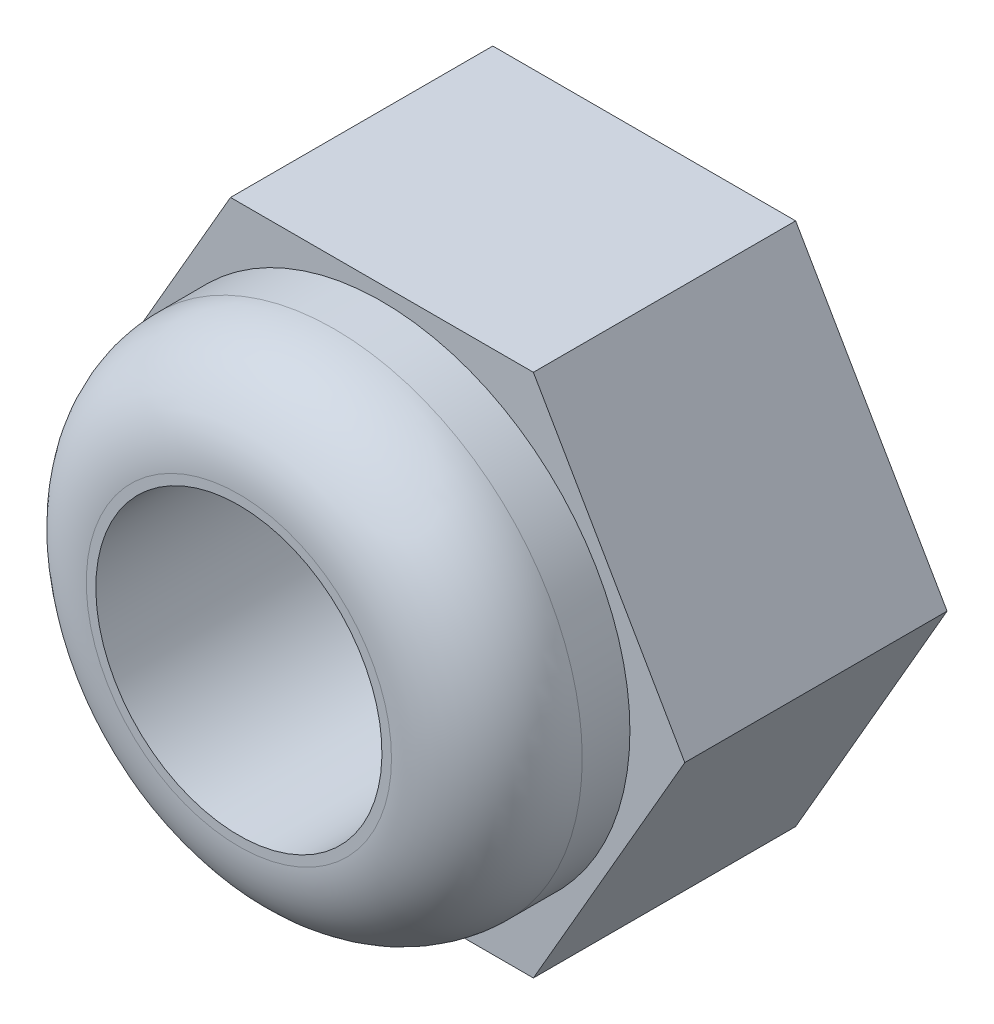
ISO-10303-21;
HEADER;
FILE_DESCRIPTION(('STEP AP214'),'2;1');
FILE_NAME('part.step','',(''),(''),'','','');
FILE_SCHEMA(('AUTOMOTIVE_DESIGN { 1 0 10303 214 1 1 1 1 }'));
ENDSEC;
DATA;
#1=APPLICATION_CONTEXT('core data for automotive mechanical design processes');
#2=APPLICATION_PROTOCOL_DEFINITION('international standard','automotive_design',2000,#1);
#3=PRODUCT_CONTEXT('',#1,'mechanical');
#4=PRODUCT('Part','Part','',(#3));
#5=PRODUCT_RELATED_PRODUCT_CATEGORY('part','',(#4));
#6=PRODUCT_DEFINITION_FORMATION('','',#4);
#7=PRODUCT_DEFINITION_CONTEXT('part definition',#1,'design');
#8=PRODUCT_DEFINITION('design','',#6,#7);
#9=PRODUCT_DEFINITION_SHAPE('','',#8);
#10=(LENGTH_UNIT() NAMED_UNIT(*) SI_UNIT(.MILLI.,.METRE.));
#11=(NAMED_UNIT(*) PLANE_ANGLE_UNIT() SI_UNIT($,.RADIAN.));
#12=(NAMED_UNIT(*) SI_UNIT($,.STERADIAN.) SOLID_ANGLE_UNIT());
#13=UNCERTAINTY_MEASURE_WITH_UNIT(LENGTH_MEASURE(1.E-05),#10,'distance_accuracy_value','');
#14=(GEOMETRIC_REPRESENTATION_CONTEXT(3) GLOBAL_UNCERTAINTY_ASSIGNED_CONTEXT((#13)) GLOBAL_UNIT_ASSIGNED_CONTEXT((#10,
#11,#12)) REPRESENTATION_CONTEXT('',''));
#15=CARTESIAN_POINT('',(0.,0.,0.));
#16=DIRECTION('',(0.,0.,1.));
#17=DIRECTION('',(1.,0.,0.));
#18=AXIS2_PLACEMENT_3D('',#15,#16,#17);
#19=CARTESIAN_POINT('',(0.,0.,2.75));
#20=DIRECTION('',(0.,0.,1.));
#21=DIRECTION('',(1.,0.,0.));
#22=AXIS2_PLACEMENT_3D('',#19,#20,#21);
#23=PLANE('',#22);
#24=CARTESIAN_POINT('',(0.,0.,2.75));
#25=DIRECTION('',(0.,0.,1.));
#26=DIRECTION('',(1.,0.,0.));
#27=AXIS2_PLACEMENT_3D('',#24,#25,#26);
#28=CIRCLE('',#27,2.6);
#29=CARTESIAN_POINT('',(2.6,0.,2.75));
#30=VERTEX_POINT('',#29);
#31=EDGE_CURVE('E20',#30,#30,#28,.T.);
#32=ORIENTED_EDGE('',*,*,#31,.F.);
#33=EDGE_LOOP('',(#32));
#34=FACE_BOUND('',#33,.T.);
#35=DIRECTION('',(0.5,0.866025403784439,0.));
#36=VECTOR('',#35,1.);
#37=CARTESIAN_POINT('',(3.17542648054294,0.,2.75));
#38=LINE('',#37,#36);
#39=CARTESIAN_POINT('',(3.17542648054294,0.,2.75));
#40=VERTEX_POINT('',#39);
#41=CARTESIAN_POINT('',(1.58771324027147,-2.75,2.75));
#42=VERTEX_POINT('',#41);
#43=EDGE_CURVE('E67',#40,#42,#38,.F.);
#44=ORIENTED_EDGE('',*,*,#43,.F.);
#45=DIRECTION('',(-0.500000000000001,0.866025403784438,0.));
#46=VECTOR('',#45,1.);
#47=CARTESIAN_POINT('',(1.58771324027147,2.75,2.75));
#48=LINE('',#47,#46);
#49=CARTESIAN_POINT('',(1.58771324027147,2.75,2.75));
#50=VERTEX_POINT('',#49);
#51=EDGE_CURVE('E157',#50,#40,#48,.F.);
#52=ORIENTED_EDGE('',*,*,#51,.F.);
#53=DIRECTION('',(1.,0.,0.));
#54=VECTOR('',#53,1.);
#55=CARTESIAN_POINT('',(-1.58771324027147,2.75,2.75));
#56=LINE('',#55,#54);
#57=CARTESIAN_POINT('',(-1.58771324027147,2.75,2.75));
#58=VERTEX_POINT('',#57);
#59=EDGE_CURVE('E153',#58,#50,#56,.T.);
#60=ORIENTED_EDGE('',*,*,#59,.F.);
#61=DIRECTION('',(-0.499999999999999,-0.866025403784439,0.));
#62=VECTOR('',#61,1.);
#63=CARTESIAN_POINT('',(-3.17542648054294,0.,2.75));
#64=LINE('',#63,#62);
#65=CARTESIAN_POINT('',(-3.17542648054294,0.,2.75));
#66=VERTEX_POINT('',#65);
#67=EDGE_CURVE('E85',#66,#58,#64,.F.);
#68=ORIENTED_EDGE('',*,*,#67,.F.);
#69=DIRECTION('',(0.500000000000001,-0.866025403784438,0.));
#70=VECTOR('',#69,1.);
#71=CARTESIAN_POINT('',(-1.58771324027147,-2.75,2.75));
#72=LINE('',#71,#70);
#73=CARTESIAN_POINT('',(-1.58771324027147,-2.75,2.75));
#74=VERTEX_POINT('',#73);
#75=EDGE_CURVE('E81',#74,#66,#72,.F.);
#76=ORIENTED_EDGE('',*,*,#75,.F.);
#77=DIRECTION('',(1.,0.,0.));
#78=VECTOR('',#77,1.);
#79=CARTESIAN_POINT('',(1.58771324027147,-2.75,2.75));
#80=LINE('',#79,#78);
#81=EDGE_CURVE('E72',#42,#74,#80,.F.);
#82=ORIENTED_EDGE('',*,*,#81,.F.);
#83=EDGE_LOOP('',(#44,#52,#60,#68,#76,#82));
#84=FACE_BOUND('',#83,.T.);
#85=ADVANCED_FACE('F16',(#34,#84),#23,.T.);
#86=CARTESIAN_POINT('',(0.,0.,2.75));
#87=DIRECTION('',(0.,0.,1.));
#88=DIRECTION('',(1.,0.,0.));
#89=AXIS2_PLACEMENT_3D('',#86,#87,#88);
#90=CYLINDRICAL_SURFACE('',#89,2.6);
#91=CARTESIAN_POINT('',(0.,0.,3.25));
#92=DIRECTION('',(0.,0.,-1.));
#93=DIRECTION('',(-1.,0.,0.));
#94=AXIS2_PLACEMENT_3D('',#91,#92,#93);
#95=CIRCLE('',#94,2.6);
#96=CARTESIAN_POINT('',(-2.6,0.,3.25));
#97=VERTEX_POINT('',#96);
#98=EDGE_CURVE('E124',#97,#97,#95,.F.);
#99=ORIENTED_EDGE('',*,*,#98,.F.);
#100=EDGE_LOOP('',(#99));
#101=FACE_BOUND('',#100,.T.);
#102=ORIENTED_EDGE('',*,*,#31,.T.);
#103=EDGE_LOOP('',(#102));
#104=FACE_BOUND('',#103,.T.);
#105=ADVANCED_FACE('F230',(#101,#104),#90,.T.);
#106=CARTESIAN_POINT('',(-1.58771324027147,-2.75,0.));
#107=DIRECTION('',(-0.866025403784438,-0.500000000000001,0.));
#108=DIRECTION('',(0.500000000000001,-0.866025403784438,0.));
#109=AXIS2_PLACEMENT_3D('',#106,#107,#108);
#110=PLANE('',#109);
#111=DIRECTION('',(0.500000000000001,-0.866025403784438,0.));
#112=VECTOR('',#111,1.);
#113=CARTESIAN_POINT('',(-3.17542648054294,0.,0.));
#114=LINE('',#113,#112);
#115=CARTESIAN_POINT('',(-3.17542648054294,0.,0.));
#116=VERTEX_POINT('',#115);
#117=CARTESIAN_POINT('',(-1.58771324027147,-2.75,0.));
#118=VERTEX_POINT('',#117);
#119=EDGE_CURVE('E92',#116,#118,#114,.T.);
#120=ORIENTED_EDGE('',*,*,#119,.T.);
#121=DIRECTION('',(0.,0.,-1.));
#122=VECTOR('',#121,1.);
#123=CARTESIAN_POINT('',(-1.58771324027147,-2.75,0.));
#124=LINE('',#123,#122);
#125=EDGE_CURVE('E77',#74,#118,#124,.T.);
#126=ORIENTED_EDGE('',*,*,#125,.F.);
#127=ORIENTED_EDGE('',*,*,#75,.T.);
#128=DIRECTION('',(0.,0.,1.));
#129=VECTOR('',#128,1.);
#130=CARTESIAN_POINT('',(-3.17542648054294,0.,0.));
#131=LINE('',#130,#129);
#132=EDGE_CURVE('E142',#116,#66,#131,.T.);
#133=ORIENTED_EDGE('',*,*,#132,.F.);
#134=EDGE_LOOP('',(#120,#126,#127,#133));
#135=FACE_BOUND('',#134,.T.);
#136=ADVANCED_FACE('F91',(#135),#110,.T.);
#137=CARTESIAN_POINT('',(1.58771324027147,-2.75,0.));
#138=DIRECTION('',(0.,-1.,0.));
#139=DIRECTION('',(0.,0.,-1.));
#140=AXIS2_PLACEMENT_3D('',#137,#138,#139);
#141=PLANE('',#140);
#142=DIRECTION('',(1.,0.,0.));
#143=VECTOR('',#142,1.);
#144=CARTESIAN_POINT('',(0.,-2.75,0.));
#145=LINE('',#144,#143);
#146=CARTESIAN_POINT('',(1.58771324027147,-2.75,0.));
#147=VERTEX_POINT('',#146);
#148=EDGE_CURVE('E121',#118,#147,#145,.T.);
#149=ORIENTED_EDGE('',*,*,#148,.T.);
#150=DIRECTION('',(0.,0.,1.));
#151=VECTOR('',#150,1.);
#152=CARTESIAN_POINT('',(1.58771324027147,-2.75,0.));
#153=LINE('',#152,#151);
#154=EDGE_CURVE('E79',#42,#147,#153,.F.);
#155=ORIENTED_EDGE('',*,*,#154,.F.);
#156=ORIENTED_EDGE('',*,*,#81,.T.);
#157=ORIENTED_EDGE('',*,*,#125,.T.);
#158=EDGE_LOOP('',(#149,#155,#156,#157));
#159=FACE_BOUND('',#158,.T.);
#160=ADVANCED_FACE('F75',(#159),#141,.T.);
#161=CARTESIAN_POINT('',(3.17542648054294,0.,0.));
#162=DIRECTION('',(0.866025403784439,-0.5,0.));
#163=DIRECTION('',(0.5,0.866025403784439,0.));
#164=AXIS2_PLACEMENT_3D('',#161,#162,#163);
#165=PLANE('',#164);
#166=DIRECTION('',(0.499999999999999,0.866025403784439,0.));
#167=VECTOR('',#166,1.);
#168=CARTESIAN_POINT('',(1.58771324027147,-2.75,0.));
#169=LINE('',#168,#167);
#170=CARTESIAN_POINT('',(3.17542648054294,0.,0.));
#171=VERTEX_POINT('',#170);
#172=EDGE_CURVE('E118',#147,#171,#169,.T.);
#173=ORIENTED_EDGE('',*,*,#172,.T.);
#174=DIRECTION('',(0.,0.,1.));
#175=VECTOR('',#174,1.);
#176=CARTESIAN_POINT('',(3.17542648054294,0.,0.));
#177=LINE('',#176,#175);
#178=EDGE_CURVE('E155',#40,#171,#177,.F.);
#179=ORIENTED_EDGE('',*,*,#178,.F.);
#180=ORIENTED_EDGE('',*,*,#43,.T.);
#181=ORIENTED_EDGE('',*,*,#154,.T.);
#182=EDGE_LOOP('',(#173,#179,#180,#181));
#183=FACE_BOUND('',#182,.T.);
#184=ADVANCED_FACE('F159',(#183),#165,.T.);
#185=CARTESIAN_POINT('',(1.58771324027147,2.75,0.));
#186=DIRECTION('',(0.866025403784438,0.500000000000001,0.));
#187=DIRECTION('',(-0.500000000000001,0.866025403784438,0.));
#188=AXIS2_PLACEMENT_3D('',#185,#186,#187);
#189=PLANE('',#188);
#190=DIRECTION('',(-0.500000000000001,0.866025403784438,0.));
#191=VECTOR('',#190,1.);
#192=CARTESIAN_POINT('',(3.17542648054294,0.,0.));
#193=LINE('',#192,#191);
#194=CARTESIAN_POINT('',(1.58771324027147,2.75,0.));
#195=VERTEX_POINT('',#194);
#196=EDGE_CURVE('E108',#171,#195,#193,.T.);
#197=ORIENTED_EDGE('',*,*,#196,.T.);
#198=DIRECTION('',(0.,0.,1.));
#199=VECTOR('',#198,1.);
#200=CARTESIAN_POINT('',(1.58771324027147,2.75,0.));
#201=LINE('',#200,#199);
#202=EDGE_CURVE('E151',#50,#195,#201,.F.);
#203=ORIENTED_EDGE('',*,*,#202,.F.);
#204=ORIENTED_EDGE('',*,*,#51,.T.);
#205=ORIENTED_EDGE('',*,*,#178,.T.);
#206=EDGE_LOOP('',(#197,#203,#204,#205));
#207=FACE_BOUND('',#206,.T.);
#208=ADVANCED_FACE('F165',(#207),#189,.T.);
#209=CARTESIAN_POINT('',(-1.58771324027147,2.75,0.));
#210=DIRECTION('',(0.,1.,0.));
#211=DIRECTION('',(0.,0.,1.));
#212=AXIS2_PLACEMENT_3D('',#209,#210,#211);
#213=PLANE('',#212);
#214=DIRECTION('',(1.,0.,0.));
#215=VECTOR('',#214,1.);
#216=CARTESIAN_POINT('',(0.,2.75,0.));
#217=LINE('',#216,#215);
#218=CARTESIAN_POINT('',(-1.58771324027147,2.75,0.));
#219=VERTEX_POINT('',#218);
#220=EDGE_CURVE('E105',#195,#219,#217,.F.);
#221=ORIENTED_EDGE('',*,*,#220,.T.);
#222=DIRECTION('',(0.,0.,1.));
#223=VECTOR('',#222,1.);
#224=CARTESIAN_POINT('',(-1.58771324027147,2.75,0.));
#225=LINE('',#224,#223);
#226=EDGE_CURVE('E35',#58,#219,#225,.F.);
#227=ORIENTED_EDGE('',*,*,#226,.F.);
#228=ORIENTED_EDGE('',*,*,#59,.T.);
#229=ORIENTED_EDGE('',*,*,#202,.T.);
#230=EDGE_LOOP('',(#221,#227,#228,#229));
#231=FACE_BOUND('',#230,.T.);
#232=ADVANCED_FACE('F168',(#231),#213,.T.);
#233=CARTESIAN_POINT('',(-3.17542648054294,0.,0.));
#234=DIRECTION('',(-0.866025403784439,0.499999999999999,0.));
#235=DIRECTION('',(-0.499999999999999,-0.866025403784439,0.));
#236=AXIS2_PLACEMENT_3D('',#233,#234,#235);
#237=PLANE('',#236);
#238=DIRECTION('',(-0.499999999999999,-0.866025403784439,0.));
#239=VECTOR('',#238,1.);
#240=CARTESIAN_POINT('',(-1.58771324027147,2.75,0.));
#241=LINE('',#240,#239);
#242=EDGE_CURVE('E101',#219,#116,#241,.T.);
#243=ORIENTED_EDGE('',*,*,#242,.T.);
#244=ORIENTED_EDGE('',*,*,#132,.T.);
#245=ORIENTED_EDGE('',*,*,#67,.T.);
#246=ORIENTED_EDGE('',*,*,#226,.T.);
#247=EDGE_LOOP('',(#243,#244,#245,#246));
#248=FACE_BOUND('',#247,.T.);
#249=ADVANCED_FACE('F135',(#248),#237,.T.);
#250=CARTESIAN_POINT('',(0.,0.,3.25));
#251=DIRECTION('',(0.,0.,-1.));
#252=DIRECTION('',(-1.,0.,0.));
#253=AXIS2_PLACEMENT_3D('',#250,#251,#252);
#254=TOROIDAL_SURFACE('',#253,1.6,1.);
#255=ORIENTED_EDGE('',*,*,#98,.T.);
#256=EDGE_LOOP('',(#255));
#257=FACE_BOUND('',#256,.T.);
#258=CARTESIAN_POINT('',(0.,0.,4.25));
#259=DIRECTION('',(0.,0.,-1.));
#260=DIRECTION('',(1.,0.,0.));
#261=AXIS2_PLACEMENT_3D('',#258,#259,#260);
#262=CIRCLE('',#261,1.6);
#263=CARTESIAN_POINT('',(1.6,0.,4.25));
#264=VERTEX_POINT('',#263);
#265=EDGE_CURVE('E97',#264,#264,#262,.T.);
#266=ORIENTED_EDGE('',*,*,#265,.T.);
#267=EDGE_LOOP('',(#266));
#268=FACE_BOUND('',#267,.T.);
#269=ADVANCED_FACE('F129',(#257,#268),#254,.T.);
#270=CARTESIAN_POINT('',(0.,0.,0.));
#271=DIRECTION('',(0.,0.,1.));
#272=DIRECTION('',(1.,0.,0.));
#273=AXIS2_PLACEMENT_3D('',#270,#271,#272);
#274=PLANE('',#273);
#275=CARTESIAN_POINT('',(0.,0.,0.));
#276=DIRECTION('',(0.,0.,-1.));
#277=DIRECTION('',(0.,1.,0.));
#278=AXIS2_PLACEMENT_3D('',#275,#276,#277);
#279=CIRCLE('',#278,1.5);
#280=CARTESIAN_POINT('',(0.,1.5,0.));
#281=VERTEX_POINT('',#280);
#282=EDGE_CURVE('E26',#281,#281,#279,.F.);
#283=ORIENTED_EDGE('',*,*,#282,.T.);
#284=EDGE_LOOP('',(#283));
#285=FACE_BOUND('',#284,.T.);
#286=ORIENTED_EDGE('',*,*,#220,.F.);
#287=ORIENTED_EDGE('',*,*,#196,.F.);
#288=ORIENTED_EDGE('',*,*,#172,.F.);
#289=ORIENTED_EDGE('',*,*,#148,.F.);
#290=ORIENTED_EDGE('',*,*,#119,.F.);
#291=ORIENTED_EDGE('',*,*,#242,.F.);
#292=EDGE_LOOP('',(#286,#287,#288,#289,#290,#291));
#293=FACE_BOUND('',#292,.T.);
#294=ADVANCED_FACE('F134',(#285,#293),#274,.F.);
#295=CARTESIAN_POINT('',(0.,0.,4.25));
#296=DIRECTION('',(0.,0.,-1.));
#297=DIRECTION('',(-1.,0.,0.));
#298=AXIS2_PLACEMENT_3D('',#295,#296,#297);
#299=PLANE('',#298);
#300=CARTESIAN_POINT('',(0.,0.,4.25));
#301=DIRECTION('',(0.,0.,-1.));
#302=DIRECTION('',(0.,1.,0.));
#303=AXIS2_PLACEMENT_3D('',#300,#301,#302);
#304=CIRCLE('',#303,1.5);
#305=CARTESIAN_POINT('',(0.,1.5,4.25));
#306=VERTEX_POINT('',#305);
#307=EDGE_CURVE('E10',#306,#306,#304,.T.);
#308=ORIENTED_EDGE('',*,*,#307,.T.);
#309=EDGE_LOOP('',(#308));
#310=FACE_BOUND('',#309,.T.);
#311=ORIENTED_EDGE('',*,*,#265,.F.);
#312=EDGE_LOOP('',(#311));
#313=FACE_BOUND('',#312,.T.);
#314=ADVANCED_FACE('F177',(#310,#313),#299,.F.);
#315=CARTESIAN_POINT('',(0.,0.,4.25));
#316=DIRECTION('',(0.,0.,-1.));
#317=DIRECTION('',(0.,1.,0.));
#318=AXIS2_PLACEMENT_3D('',#315,#316,#317);
#319=CYLINDRICAL_SURFACE('',#318,1.5);
#320=ORIENTED_EDGE('',*,*,#307,.F.);
#321=EDGE_LOOP('',(#320));
#322=FACE_BOUND('',#321,.T.);
#323=ORIENTED_EDGE('',*,*,#282,.F.);
#324=EDGE_LOOP('',(#323));
#325=FACE_BOUND('',#324,.T.);
#326=ADVANCED_FACE('F18',(#322,#325),#319,.F.);
#327=CLOSED_SHELL('',(#85,#105,#136,#160,#184,#208,#232,#249,#269,#294,#314,#326));
#328=MANIFOLD_SOLID_BREP('B1',#327);
#329=ADVANCED_BREP_SHAPE_REPRESENTATION('',(#18,#328),#14);
#330=SHAPE_DEFINITION_REPRESENTATION(#9,#329);
ENDSEC;
END-ISO-10303-21;
